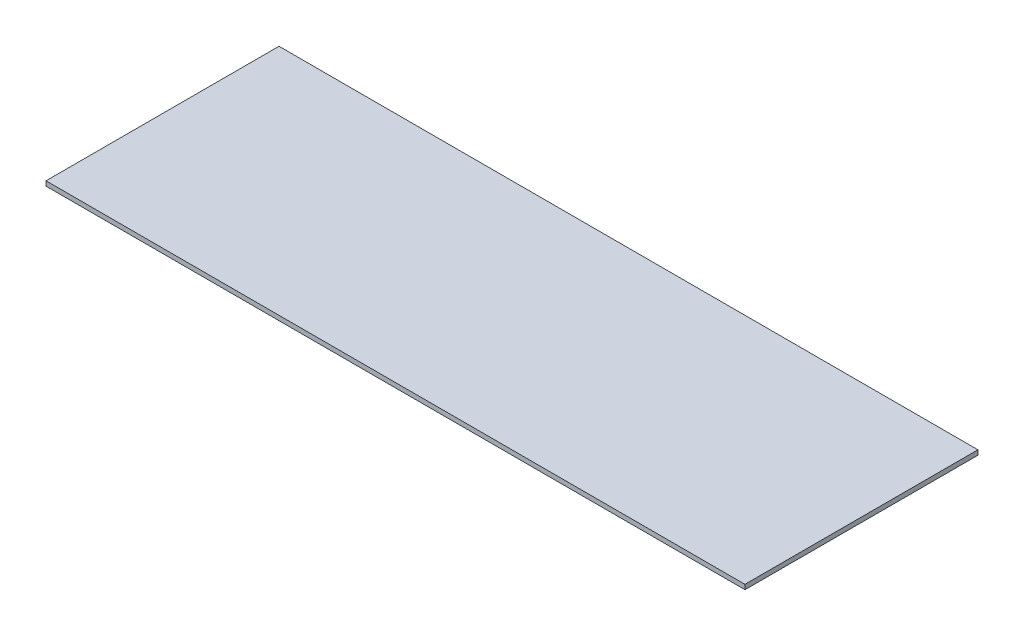
ISO-10303-21;
HEADER;
FILE_DESCRIPTION(('STEP AP214'),'2;1');
FILE_NAME('part.step','',(''),(''),'','','');
FILE_SCHEMA(('AUTOMOTIVE_DESIGN { 1 0 10303 214 1 1 1 1 }'));
ENDSEC;
DATA;
#1=APPLICATION_CONTEXT('core data for automotive mechanical design processes');
#2=APPLICATION_PROTOCOL_DEFINITION('international standard','automotive_design',2000,#1);
#3=PRODUCT_CONTEXT('',#1,'mechanical');
#4=PRODUCT('Part','Part','',(#3));
#5=PRODUCT_RELATED_PRODUCT_CATEGORY('part','',(#4));
#6=PRODUCT_DEFINITION_FORMATION('','',#4);
#7=PRODUCT_DEFINITION_CONTEXT('part definition',#1,'design');
#8=PRODUCT_DEFINITION('design','',#6,#7);
#9=PRODUCT_DEFINITION_SHAPE('','',#8);
#10=(LENGTH_UNIT() NAMED_UNIT(*) SI_UNIT(.MILLI.,.METRE.));
#11=(NAMED_UNIT(*) PLANE_ANGLE_UNIT() SI_UNIT($,.RADIAN.));
#12=(NAMED_UNIT(*) SI_UNIT($,.STERADIAN.) SOLID_ANGLE_UNIT());
#13=UNCERTAINTY_MEASURE_WITH_UNIT(LENGTH_MEASURE(1.E-05),#10,'distance_accuracy_value','');
#14=(GEOMETRIC_REPRESENTATION_CONTEXT(3) GLOBAL_UNCERTAINTY_ASSIGNED_CONTEXT((#13)) GLOBAL_UNIT_ASSIGNED_CONTEXT((#10,
#11,#12)) REPRESENTATION_CONTEXT('',''));
#15=CARTESIAN_POINT('',(0.,0.,0.));
#16=DIRECTION('',(0.,0.,1.));
#17=DIRECTION('',(1.,0.,0.));
#18=AXIS2_PLACEMENT_3D('',#15,#16,#17);
#19=CARTESIAN_POINT('',(-150.,2.,-50.));
#20=DIRECTION('',(0.,0.,1.));
#21=DIRECTION('',(1.,0.,0.));
#22=AXIS2_PLACEMENT_3D('',#19,#20,#21);
#23=PLANE('',#22);
#24=DIRECTION('',(-1.,0.,0.));
#25=VECTOR('',#24,1.);
#26=CARTESIAN_POINT('',(-150.,0.,-50.));
#27=LINE('',#26,#25);
#28=CARTESIAN_POINT('',(150.,0.,-50.));
#29=VERTEX_POINT('',#28);
#30=CARTESIAN_POINT('',(-149.965089870144,0.,-50.));
#31=VERTEX_POINT('',#30);
#32=EDGE_CURVE('E101',#29,#31,#27,.T.);
#33=ORIENTED_EDGE('',*,*,#32,.T.);
#34=DIRECTION('',(-0.0174524064372811,0.999847695156391,0.));
#35=VECTOR('',#34,1.);
#36=CARTESIAN_POINT('',(-150.,2.,-50.));
#37=LINE('',#36,#35);
#38=CARTESIAN_POINT('',(-150.,2.,-50.));
#39=VERTEX_POINT('',#38);
#40=EDGE_CURVE('E56',#31,#39,#37,.T.);
#41=ORIENTED_EDGE('',*,*,#40,.T.);
#42=DIRECTION('',(-1.,0.,0.));
#43=VECTOR('',#42,1.);
#44=CARTESIAN_POINT('',(-150.,2.,-50.));
#45=LINE('',#44,#43);
#46=CARTESIAN_POINT('',(149.965089870144,2.,-50.));
#47=VERTEX_POINT('',#46);
#48=EDGE_CURVE('E100',#47,#39,#45,.T.);
#49=ORIENTED_EDGE('',*,*,#48,.F.);
#50=DIRECTION('',(0.0174524064372672,-0.999847695156391,0.));
#51=VECTOR('',#50,1.);
#52=CARTESIAN_POINT('',(150.,0.,-50.));
#53=LINE('',#52,#51);
#54=EDGE_CURVE('E115',#47,#29,#53,.T.);
#55=ORIENTED_EDGE('',*,*,#54,.T.);
#56=EDGE_LOOP('',(#33,#41,#49,#55));
#57=FACE_BOUND('',#56,.T.);
#58=ADVANCED_FACE('F39',(#57),#23,.F.);
#59=CARTESIAN_POINT('',(-150.,2.,50.));
#60=DIRECTION('',(0.,0.,-1.));
#61=DIRECTION('',(-1.,0.,0.));
#62=AXIS2_PLACEMENT_3D('',#59,#60,#61);
#63=PLANE('',#62);
#64=DIRECTION('',(1.,0.,0.));
#65=VECTOR('',#64,1.);
#66=CARTESIAN_POINT('',(-150.,2.,50.));
#67=LINE('',#66,#65);
#68=CARTESIAN_POINT('',(-150.,2.,50.));
#69=VERTEX_POINT('',#68);
#70=CARTESIAN_POINT('',(149.965089870144,2.,50.));
#71=VERTEX_POINT('',#70);
#72=EDGE_CURVE('E11',#69,#71,#67,.T.);
#73=ORIENTED_EDGE('',*,*,#72,.F.);
#74=DIRECTION('',(-0.0174524064372811,0.999847695156391,0.));
#75=VECTOR('',#74,1.);
#76=CARTESIAN_POINT('',(-150.,2.,50.));
#77=LINE('',#76,#75);
#78=CARTESIAN_POINT('',(-149.965089870144,0.,50.));
#79=VERTEX_POINT('',#78);
#80=EDGE_CURVE('E82',#79,#69,#77,.T.);
#81=ORIENTED_EDGE('',*,*,#80,.F.);
#82=DIRECTION('',(1.,0.,0.));
#83=VECTOR('',#82,1.);
#84=CARTESIAN_POINT('',(-150.,0.,50.));
#85=LINE('',#84,#83);
#86=CARTESIAN_POINT('',(150.,0.,50.));
#87=VERTEX_POINT('',#86);
#88=EDGE_CURVE('E42',#79,#87,#85,.T.);
#89=ORIENTED_EDGE('',*,*,#88,.T.);
#90=DIRECTION('',(0.0174524064372672,-0.999847695156391,0.));
#91=VECTOR('',#90,1.);
#92=CARTESIAN_POINT('',(150.,0.,50.));
#93=LINE('',#92,#91);
#94=EDGE_CURVE('E64',#71,#87,#93,.T.);
#95=ORIENTED_EDGE('',*,*,#94,.F.);
#96=EDGE_LOOP('',(#73,#81,#89,#95));
#97=FACE_BOUND('',#96,.T.);
#98=ADVANCED_FACE('F93',(#97),#63,.F.);
#99=CARTESIAN_POINT('',(0.,2.,0.));
#100=DIRECTION('',(0.,-1.,0.));
#101=DIRECTION('',(0.,0.,-1.));
#102=AXIS2_PLACEMENT_3D('',#99,#100,#101);
#103=PLANE('',#102);
#104=ORIENTED_EDGE('',*,*,#72,.T.);
#105=DIRECTION('',(0.,0.,1.));
#106=VECTOR('',#105,1.);
#107=CARTESIAN_POINT('',(149.965089870144,2.,-50.));
#108=LINE('',#107,#106);
#109=EDGE_CURVE('E96',#47,#71,#108,.T.);
#110=ORIENTED_EDGE('',*,*,#109,.F.);
#111=ORIENTED_EDGE('',*,*,#48,.T.);
#112=DIRECTION('',(0.,0.,1.));
#113=VECTOR('',#112,1.);
#114=CARTESIAN_POINT('',(-150.,2.,50.));
#115=LINE('',#114,#113);
#116=EDGE_CURVE('E48',#39,#69,#115,.T.);
#117=ORIENTED_EDGE('',*,*,#116,.T.);
#118=EDGE_LOOP('',(#104,#110,#111,#117));
#119=FACE_BOUND('',#118,.T.);
#120=ADVANCED_FACE('F124',(#119),#103,.F.);
#121=CARTESIAN_POINT('',(0.,0.,0.));
#122=DIRECTION('',(0.,-1.,0.));
#123=DIRECTION('',(0.,0.,-1.));
#124=AXIS2_PLACEMENT_3D('',#121,#122,#123);
#125=PLANE('',#124);
#126=DIRECTION('',(0.,0.,1.));
#127=VECTOR('',#126,1.);
#128=CARTESIAN_POINT('',(-149.965089870144,0.,-50.));
#129=LINE('',#128,#127);
#130=EDGE_CURVE('E79',#31,#79,#129,.T.);
#131=ORIENTED_EDGE('',*,*,#130,.F.);
#132=ORIENTED_EDGE('',*,*,#32,.F.);
#133=DIRECTION('',(0.,0.,-1.));
#134=VECTOR('',#133,1.);
#135=CARTESIAN_POINT('',(150.,0.,50.));
#136=LINE('',#135,#134);
#137=EDGE_CURVE('E89',#87,#29,#136,.T.);
#138=ORIENTED_EDGE('',*,*,#137,.F.);
#139=ORIENTED_EDGE('',*,*,#88,.F.);
#140=EDGE_LOOP('',(#131,#132,#138,#139));
#141=FACE_BOUND('',#140,.T.);
#142=ADVANCED_FACE('F98',(#141),#125,.T.);
#143=CARTESIAN_POINT('',(150.,0.,-50.));
#144=DIRECTION('',(-0.999847695156392,-0.0174524064372672,0.));
#145=DIRECTION('',(0.0174524064372672,-0.999847695156392,0.));
#146=AXIS2_PLACEMENT_3D('',#143,#144,#145);
#147=PLANE('',#146);
#148=ORIENTED_EDGE('',*,*,#94,.T.);
#149=ORIENTED_EDGE('',*,*,#137,.T.);
#150=ORIENTED_EDGE('',*,*,#54,.F.);
#151=ORIENTED_EDGE('',*,*,#109,.T.);
#152=EDGE_LOOP('',(#148,#149,#150,#151));
#153=FACE_BOUND('',#152,.T.);
#154=ADVANCED_FACE('F125',(#153),#147,.F.);
#155=CARTESIAN_POINT('',(-150.,2.,-50.));
#156=DIRECTION('',(0.999847695156391,0.0174524064372811,0.));
#157=DIRECTION('',(-0.0174524064372811,0.999847695156391,0.));
#158=AXIS2_PLACEMENT_3D('',#155,#156,#157);
#159=PLANE('',#158);
#160=ORIENTED_EDGE('',*,*,#80,.T.);
#161=ORIENTED_EDGE('',*,*,#116,.F.);
#162=ORIENTED_EDGE('',*,*,#40,.F.);
#163=ORIENTED_EDGE('',*,*,#130,.T.);
#164=EDGE_LOOP('',(#160,#161,#162,#163));
#165=FACE_BOUND('',#164,.T.);
#166=ADVANCED_FACE('F81',(#165),#159,.F.);
#167=CLOSED_SHELL('',(#58,#98,#120,#142,#154,#166));
#168=MANIFOLD_SOLID_BREP('B2',#167);
#169=ADVANCED_BREP_SHAPE_REPRESENTATION('',(#18,#168),#14);
#170=SHAPE_DEFINITION_REPRESENTATION(#9,#169);
ENDSEC;
END-ISO-10303-21;
